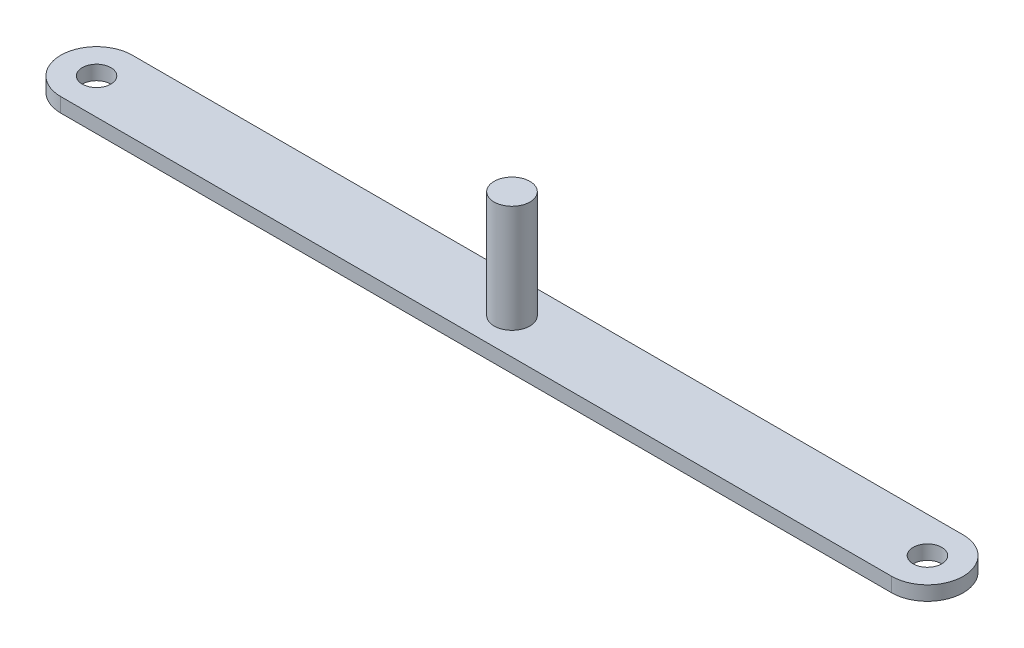
ISO-10303-21;
HEADER;
FILE_DESCRIPTION(('STEP AP214'),'2;1');
FILE_NAME('part.step','',(''),(''),'','','');
FILE_SCHEMA(('AUTOMOTIVE_DESIGN { 1 0 10303 214 1 1 1 1 }'));
ENDSEC;
DATA;
#1=APPLICATION_CONTEXT('core data for automotive mechanical design processes');
#2=APPLICATION_PROTOCOL_DEFINITION('international standard','automotive_design',2000,#1);
#3=PRODUCT_CONTEXT('',#1,'mechanical');
#4=PRODUCT('Part','Part','',(#3));
#5=PRODUCT_RELATED_PRODUCT_CATEGORY('part','',(#4));
#6=PRODUCT_DEFINITION_FORMATION('','',#4);
#7=PRODUCT_DEFINITION_CONTEXT('part definition',#1,'design');
#8=PRODUCT_DEFINITION('design','',#6,#7);
#9=PRODUCT_DEFINITION_SHAPE('','',#8);
#10=(LENGTH_UNIT() NAMED_UNIT(*) SI_UNIT(.MILLI.,.METRE.));
#11=(NAMED_UNIT(*) PLANE_ANGLE_UNIT() SI_UNIT($,.RADIAN.));
#12=(NAMED_UNIT(*) SI_UNIT($,.STERADIAN.) SOLID_ANGLE_UNIT());
#13=UNCERTAINTY_MEASURE_WITH_UNIT(LENGTH_MEASURE(1.E-05),#10,'distance_accuracy_value','');
#14=(GEOMETRIC_REPRESENTATION_CONTEXT(3) GLOBAL_UNCERTAINTY_ASSIGNED_CONTEXT((#13)) GLOBAL_UNIT_ASSIGNED_CONTEXT((#10,
#11,#12)) REPRESENTATION_CONTEXT('',''));
#15=CARTESIAN_POINT('',(0.,0.,0.));
#16=DIRECTION('',(0.,0.,1.));
#17=DIRECTION('',(1.,0.,0.));
#18=AXIS2_PLACEMENT_3D('',#15,#16,#17);
#19=CARTESIAN_POINT('',(-58.,2.,0.));
#20=DIRECTION('',(0.,1.,0.));
#21=DIRECTION('',(0.,0.,1.));
#22=AXIS2_PLACEMENT_3D('',#19,#20,#21);
#23=PLANE('',#22);
#24=CARTESIAN_POINT('',(0.,2.,0.));
#25=DIRECTION('',(0.,1.,0.));
#26=DIRECTION('',(0.,0.,1.));
#27=AXIS2_PLACEMENT_3D('',#24,#25,#26);
#28=CIRCLE('',#27,2.5);
#29=CARTESIAN_POINT('',(0.,2.,2.5));
#30=VERTEX_POINT('',#29);
#31=EDGE_CURVE('E150',#30,#30,#28,.T.);
#32=ORIENTED_EDGE('',*,*,#31,.F.);
#33=EDGE_LOOP('',(#32));
#34=FACE_BOUND('',#33,.T.);
#35=CARTESIAN_POINT('',(-58.,2.,0.));
#36=DIRECTION('',(0.,1.,0.));
#37=DIRECTION('',(0.,0.,1.));
#38=AXIS2_PLACEMENT_3D('',#35,#36,#37);
#39=CIRCLE('',#38,2.);
#40=CARTESIAN_POINT('',(-58.,2.,2.));
#41=VERTEX_POINT('',#40);
#42=EDGE_CURVE('E116',#41,#41,#39,.T.);
#43=ORIENTED_EDGE('',*,*,#42,.F.);
#44=EDGE_LOOP('',(#43));
#45=FACE_BOUND('',#44,.T.);
#46=CARTESIAN_POINT('',(-58.,2.,0.));
#47=DIRECTION('',(0.,1.,0.));
#48=DIRECTION('',(0.,0.,1.));
#49=AXIS2_PLACEMENT_3D('',#46,#47,#48);
#50=CIRCLE('',#49,5.);
#51=CARTESIAN_POINT('',(-58.,2.,-5.));
#52=VERTEX_POINT('',#51);
#53=CARTESIAN_POINT('',(-58.,2.,5.));
#54=VERTEX_POINT('',#53);
#55=EDGE_CURVE('E96',#52,#54,#50,.T.);
#56=ORIENTED_EDGE('',*,*,#55,.T.);
#57=DIRECTION('',(1.,0.,0.));
#58=VECTOR('',#57,1.);
#59=CARTESIAN_POINT('',(-58.,2.,5.));
#60=LINE('',#59,#58);
#61=CARTESIAN_POINT('',(58.,2.,4.99999999999998));
#62=VERTEX_POINT('',#61);
#63=EDGE_CURVE('E91',#54,#62,#60,.T.);
#64=ORIENTED_EDGE('',*,*,#63,.T.);
#65=CARTESIAN_POINT('',(58.,2.,0.));
#66=DIRECTION('',(0.,1.,0.));
#67=DIRECTION('',(0.,0.,1.));
#68=AXIS2_PLACEMENT_3D('',#65,#66,#67);
#69=CIRCLE('',#68,5.);
#70=CARTESIAN_POINT('',(58.,2.,-5.00000000000002));
#71=VERTEX_POINT('',#70);
#72=EDGE_CURVE('E94',#62,#71,#69,.T.);
#73=ORIENTED_EDGE('',*,*,#72,.T.);
#74=DIRECTION('',(-1.,0.,0.));
#75=VECTOR('',#74,1.);
#76=CARTESIAN_POINT('',(-58.,2.,-5.));
#77=LINE('',#76,#75);
#78=EDGE_CURVE('E61',#71,#52,#77,.T.);
#79=ORIENTED_EDGE('',*,*,#78,.T.);
#80=EDGE_LOOP('',(#56,#64,#73,#79));
#81=FACE_BOUND('',#80,.T.);
#82=CARTESIAN_POINT('',(58.,2.,0.));
#83=DIRECTION('',(0.,1.,0.));
#84=DIRECTION('',(0.,0.,1.));
#85=AXIS2_PLACEMENT_3D('',#82,#83,#84);
#86=CIRCLE('',#85,2.);
#87=CARTESIAN_POINT('',(58.,2.,1.99999999999997));
#88=VERTEX_POINT('',#87);
#89=EDGE_CURVE('E138',#88,#88,#86,.T.);
#90=ORIENTED_EDGE('',*,*,#89,.F.);
#91=EDGE_LOOP('',(#90));
#92=FACE_BOUND('',#91,.T.);
#93=ADVANCED_FACE('F43',(#34,#45,#81,#92),#23,.T.);
#94=CARTESIAN_POINT('',(-58.,0.,0.));
#95=DIRECTION('',(0.,1.,0.));
#96=DIRECTION('',(0.,0.,1.));
#97=AXIS2_PLACEMENT_3D('',#94,#95,#96);
#98=PLANE('',#97);
#99=CARTESIAN_POINT('',(-58.,0.,0.));
#100=DIRECTION('',(0.,1.,0.));
#101=DIRECTION('',(0.,0.,1.));
#102=AXIS2_PLACEMENT_3D('',#99,#100,#101);
#103=CIRCLE('',#102,5.);
#104=CARTESIAN_POINT('',(-58.,0.,-5.));
#105=VERTEX_POINT('',#104);
#106=CARTESIAN_POINT('',(-58.,0.,5.));
#107=VERTEX_POINT('',#106);
#108=EDGE_CURVE('E112',#105,#107,#103,.T.);
#109=ORIENTED_EDGE('',*,*,#108,.F.);
#110=DIRECTION('',(-1.,0.,0.));
#111=VECTOR('',#110,1.);
#112=CARTESIAN_POINT('',(-58.,0.,-5.));
#113=LINE('',#112,#111);
#114=CARTESIAN_POINT('',(58.,0.,-5.00000000000002));
#115=VERTEX_POINT('',#114);
#116=EDGE_CURVE('E84',#115,#105,#113,.T.);
#117=ORIENTED_EDGE('',*,*,#116,.F.);
#118=CARTESIAN_POINT('',(58.,0.,0.));
#119=DIRECTION('',(0.,1.,0.));
#120=DIRECTION('',(0.,0.,1.));
#121=AXIS2_PLACEMENT_3D('',#118,#119,#120);
#122=CIRCLE('',#121,5.);
#123=CARTESIAN_POINT('',(58.,0.,4.99999999999998));
#124=VERTEX_POINT('',#123);
#125=EDGE_CURVE('E78',#124,#115,#122,.T.);
#126=ORIENTED_EDGE('',*,*,#125,.F.);
#127=DIRECTION('',(1.,0.,0.));
#128=VECTOR('',#127,1.);
#129=CARTESIAN_POINT('',(-58.,0.,5.));
#130=LINE('',#129,#128);
#131=EDGE_CURVE('E101',#107,#124,#130,.T.);
#132=ORIENTED_EDGE('',*,*,#131,.F.);
#133=EDGE_LOOP('',(#109,#117,#126,#132));
#134=FACE_BOUND('',#133,.T.);
#135=CARTESIAN_POINT('',(-58.,0.,0.));
#136=DIRECTION('',(0.,1.,0.));
#137=DIRECTION('',(0.,0.,1.));
#138=AXIS2_PLACEMENT_3D('',#135,#136,#137);
#139=CIRCLE('',#138,2.);
#140=CARTESIAN_POINT('',(-58.,0.,2.));
#141=VERTEX_POINT('',#140);
#142=EDGE_CURVE('E134',#141,#141,#139,.T.);
#143=ORIENTED_EDGE('',*,*,#142,.T.);
#144=EDGE_LOOP('',(#143));
#145=FACE_BOUND('',#144,.T.);
#146=CARTESIAN_POINT('',(58.,0.,0.));
#147=DIRECTION('',(0.,1.,0.));
#148=DIRECTION('',(0.,0.,1.));
#149=AXIS2_PLACEMENT_3D('',#146,#147,#148);
#150=CIRCLE('',#149,2.);
#151=CARTESIAN_POINT('',(58.,0.,1.99999999999997));
#152=VERTEX_POINT('',#151);
#153=EDGE_CURVE('E142',#152,#152,#150,.T.);
#154=ORIENTED_EDGE('',*,*,#153,.T.);
#155=EDGE_LOOP('',(#154));
#156=FACE_BOUND('',#155,.T.);
#157=ADVANCED_FACE('F129',(#134,#145,#156),#98,.F.);
#158=CARTESIAN_POINT('',(-58.,2.,0.));
#159=DIRECTION('',(0.,-1.,0.));
#160=DIRECTION('',(0.,0.,-1.));
#161=AXIS2_PLACEMENT_3D('',#158,#159,#160);
#162=CYLINDRICAL_SURFACE('',#161,5.);
#163=ORIENTED_EDGE('',*,*,#108,.T.);
#164=DIRECTION('',(0.,-1.,0.));
#165=VECTOR('',#164,1.);
#166=CARTESIAN_POINT('',(-58.,2.,5.));
#167=LINE('',#166,#165);
#168=EDGE_CURVE('E11',#54,#107,#167,.T.);
#169=ORIENTED_EDGE('',*,*,#168,.F.);
#170=ORIENTED_EDGE('',*,*,#55,.F.);
#171=DIRECTION('',(0.,-1.,0.));
#172=VECTOR('',#171,1.);
#173=CARTESIAN_POINT('',(-58.,2.,-5.));
#174=LINE('',#173,#172);
#175=EDGE_CURVE('E108',#52,#105,#174,.T.);
#176=ORIENTED_EDGE('',*,*,#175,.T.);
#177=EDGE_LOOP('',(#163,#169,#170,#176));
#178=FACE_BOUND('',#177,.T.);
#179=ADVANCED_FACE('F45',(#178),#162,.T.);
#180=CARTESIAN_POINT('',(-58.,2.,5.));
#181=DIRECTION('',(0.,0.,-1.));
#182=DIRECTION('',(-1.,0.,0.));
#183=AXIS2_PLACEMENT_3D('',#180,#181,#182);
#184=PLANE('',#183);
#185=ORIENTED_EDGE('',*,*,#131,.T.);
#186=DIRECTION('',(0.,-1.,0.));
#187=VECTOR('',#186,1.);
#188=CARTESIAN_POINT('',(58.,2.,4.99999999999998));
#189=LINE('',#188,#187);
#190=EDGE_CURVE('E53',#62,#124,#189,.T.);
#191=ORIENTED_EDGE('',*,*,#190,.F.);
#192=ORIENTED_EDGE('',*,*,#63,.F.);
#193=ORIENTED_EDGE('',*,*,#168,.T.);
#194=EDGE_LOOP('',(#185,#191,#192,#193));
#195=FACE_BOUND('',#194,.T.);
#196=ADVANCED_FACE('F100',(#195),#184,.F.);
#197=CARTESIAN_POINT('',(58.,2.,0.));
#198=DIRECTION('',(0.,-1.,0.));
#199=DIRECTION('',(0.,0.,-1.));
#200=AXIS2_PLACEMENT_3D('',#197,#198,#199);
#201=CYLINDRICAL_SURFACE('',#200,5.);
#202=ORIENTED_EDGE('',*,*,#125,.T.);
#203=DIRECTION('',(0.,-1.,0.));
#204=VECTOR('',#203,1.);
#205=CARTESIAN_POINT('',(58.,2.,-5.00000000000002));
#206=LINE('',#205,#204);
#207=EDGE_CURVE('E103',#71,#115,#206,.T.);
#208=ORIENTED_EDGE('',*,*,#207,.F.);
#209=ORIENTED_EDGE('',*,*,#72,.F.);
#210=ORIENTED_EDGE('',*,*,#190,.T.);
#211=EDGE_LOOP('',(#202,#208,#209,#210));
#212=FACE_BOUND('',#211,.T.);
#213=ADVANCED_FACE('F104',(#212),#201,.T.);
#214=CARTESIAN_POINT('',(-58.,2.,-5.));
#215=DIRECTION('',(0.,0.,1.));
#216=DIRECTION('',(1.,0.,0.));
#217=AXIS2_PLACEMENT_3D('',#214,#215,#216);
#218=PLANE('',#217);
#219=ORIENTED_EDGE('',*,*,#116,.T.);
#220=ORIENTED_EDGE('',*,*,#175,.F.);
#221=ORIENTED_EDGE('',*,*,#78,.F.);
#222=ORIENTED_EDGE('',*,*,#207,.T.);
#223=EDGE_LOOP('',(#219,#220,#221,#222));
#224=FACE_BOUND('',#223,.T.);
#225=ADVANCED_FACE('F126',(#224),#218,.F.);
#226=CARTESIAN_POINT('',(-58.,2.,0.));
#227=DIRECTION('',(0.,-1.,0.));
#228=DIRECTION('',(0.,0.,-1.));
#229=AXIS2_PLACEMENT_3D('',#226,#227,#228);
#230=CYLINDRICAL_SURFACE('',#229,2.);
#231=ORIENTED_EDGE('',*,*,#42,.T.);
#232=EDGE_LOOP('',(#231));
#233=FACE_BOUND('',#232,.T.);
#234=ORIENTED_EDGE('',*,*,#142,.F.);
#235=EDGE_LOOP('',(#234));
#236=FACE_BOUND('',#235,.T.);
#237=ADVANCED_FACE('F172',(#233,#236),#230,.F.);
#238=CARTESIAN_POINT('',(58.,2.,0.));
#239=DIRECTION('',(0.,-1.,0.));
#240=DIRECTION('',(0.,0.,-1.));
#241=AXIS2_PLACEMENT_3D('',#238,#239,#240);
#242=CYLINDRICAL_SURFACE('',#241,2.);
#243=ORIENTED_EDGE('',*,*,#89,.T.);
#244=EDGE_LOOP('',(#243));
#245=FACE_BOUND('',#244,.T.);
#246=ORIENTED_EDGE('',*,*,#153,.F.);
#247=EDGE_LOOP('',(#246));
#248=FACE_BOUND('',#247,.T.);
#249=ADVANCED_FACE('F163',(#245,#248),#242,.F.);
#250=CARTESIAN_POINT('',(0.,17.,0.));
#251=DIRECTION('',(0.,-1.,0.));
#252=DIRECTION('',(0.,0.,-1.));
#253=AXIS2_PLACEMENT_3D('',#250,#251,#252);
#254=CYLINDRICAL_SURFACE('',#253,2.5);
#255=CARTESIAN_POINT('',(0.,17.,0.));
#256=DIRECTION('',(0.,1.,0.));
#257=DIRECTION('',(0.,0.,1.));
#258=AXIS2_PLACEMENT_3D('',#255,#256,#257);
#259=CIRCLE('',#258,2.5);
#260=CARTESIAN_POINT('',(0.,17.,2.5));
#261=VERTEX_POINT('',#260);
#262=EDGE_CURVE('E146',#261,#261,#259,.T.);
#263=ORIENTED_EDGE('',*,*,#262,.F.);
#264=EDGE_LOOP('',(#263));
#265=FACE_BOUND('',#264,.T.);
#266=ORIENTED_EDGE('',*,*,#31,.T.);
#267=EDGE_LOOP('',(#266));
#268=FACE_BOUND('',#267,.T.);
#269=ADVANCED_FACE('F160',(#265,#268),#254,.T.);
#270=CARTESIAN_POINT('',(0.,17.,0.));
#271=DIRECTION('',(0.,1.,0.));
#272=DIRECTION('',(0.,0.,1.));
#273=AXIS2_PLACEMENT_3D('',#270,#271,#272);
#274=PLANE('',#273);
#275=ORIENTED_EDGE('',*,*,#262,.T.);
#276=EDGE_LOOP('',(#275));
#277=FACE_BOUND('',#276,.T.);
#278=ADVANCED_FACE('F158',(#277),#274,.T.);
#279=CLOSED_SHELL('',(#93,#157,#179,#196,#213,#225,#237,#249,#269,#278));
#280=MANIFOLD_SOLID_BREP('B2',#279);
#281=ADVANCED_BREP_SHAPE_REPRESENTATION('',(#18,#280),#14);
#282=SHAPE_DEFINITION_REPRESENTATION(#9,#281);
ENDSEC;
END-ISO-10303-21;
